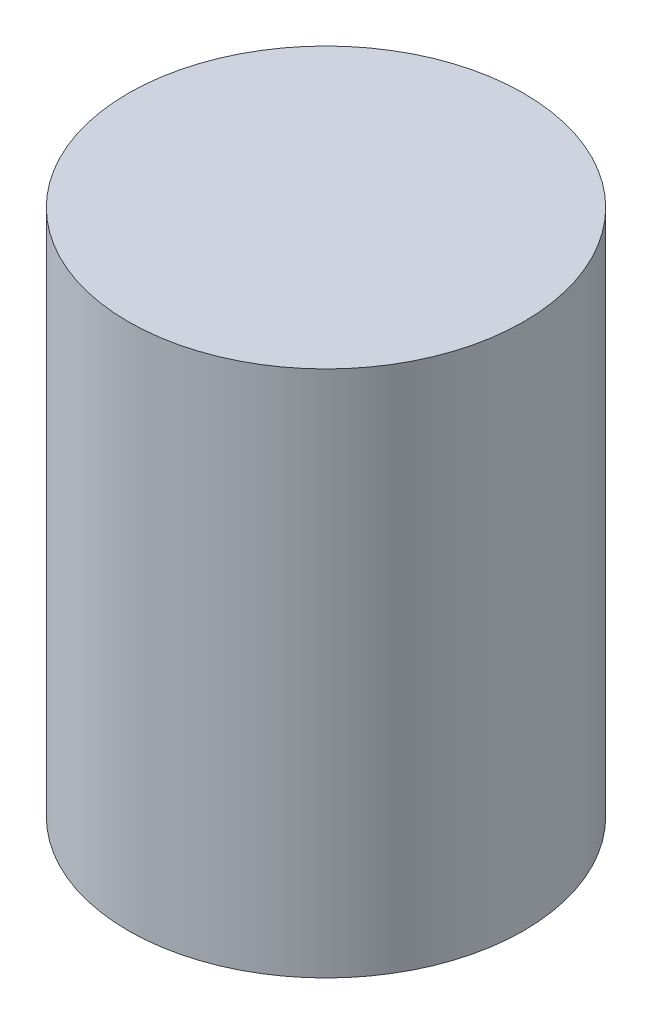
ISO-10303-21;
HEADER;
FILE_DESCRIPTION(('STEP AP214'),'2;1');
FILE_NAME('part.step','',(''),(''),'','','');
FILE_SCHEMA(('AUTOMOTIVE_DESIGN { 1 0 10303 214 1 1 1 1 }'));
ENDSEC;
DATA;
#1=APPLICATION_CONTEXT('core data for automotive mechanical design processes');
#2=APPLICATION_PROTOCOL_DEFINITION('international standard','automotive_design',2000,#1);
#3=PRODUCT_CONTEXT('',#1,'mechanical');
#4=PRODUCT('Part','Part','',(#3));
#5=PRODUCT_RELATED_PRODUCT_CATEGORY('part','',(#4));
#6=PRODUCT_DEFINITION_FORMATION('','',#4);
#7=PRODUCT_DEFINITION_CONTEXT('part definition',#1,'design');
#8=PRODUCT_DEFINITION('design','',#6,#7);
#9=PRODUCT_DEFINITION_SHAPE('','',#8);
#10=(LENGTH_UNIT() NAMED_UNIT(*) SI_UNIT(.MILLI.,.METRE.));
#11=(NAMED_UNIT(*) PLANE_ANGLE_UNIT() SI_UNIT($,.RADIAN.));
#12=(NAMED_UNIT(*) SI_UNIT($,.STERADIAN.) SOLID_ANGLE_UNIT());
#13=UNCERTAINTY_MEASURE_WITH_UNIT(LENGTH_MEASURE(1.E-05),#10,'distance_accuracy_value','');
#14=(GEOMETRIC_REPRESENTATION_CONTEXT(3) GLOBAL_UNCERTAINTY_ASSIGNED_CONTEXT((#13)) GLOBAL_UNIT_ASSIGNED_CONTEXT((#10,
#11,#12)) REPRESENTATION_CONTEXT('',''));
#15=CARTESIAN_POINT('',(0.,0.,0.));
#16=DIRECTION('',(0.,0.,1.));
#17=DIRECTION('',(1.,0.,0.));
#18=AXIS2_PLACEMENT_3D('',#15,#16,#17);
#19=CARTESIAN_POINT('',(0.,80.0000000000002,0.));
#20=DIRECTION('',(0.,1.00000000000001,0.));
#21=DIRECTION('',(0.,0.,1.));
#22=AXIS2_PLACEMENT_3D('',#19,#20,#21);
#23=PLANE('',#22);
#24=CARTESIAN_POINT('',(0.,80.0000000000002,0.));
#25=DIRECTION('',(0.,-1.00000000000001,0.));
#26=DIRECTION('',(0.,0.,-1.));
#27=AXIS2_PLACEMENT_3D('',#24,#25,#26);
#28=CIRCLE('',#27,30.);
#29=CARTESIAN_POINT('',(0.,80.0000000000002,-30.));
#30=VERTEX_POINT('',#29);
#31=EDGE_CURVE('E12',#30,#30,#28,.T.);
#32=ORIENTED_EDGE('',*,*,#31,.F.);
#33=EDGE_LOOP('',(#32));
#34=FACE_BOUND('',#33,.T.);
#35=ADVANCED_FACE('F40',(#34),#23,.T.);
#36=CARTESIAN_POINT('',(0.,0.,0.));
#37=DIRECTION('',(0.,-1.00000000000001,0.));
#38=DIRECTION('',(0.,0.,-1.));
#39=AXIS2_PLACEMENT_3D('',#36,#37,#38);
#40=CYLINDRICAL_SURFACE('',#39,30.);
#41=ORIENTED_EDGE('',*,*,#31,.T.);
#42=EDGE_LOOP('',(#41));
#43=FACE_BOUND('',#42,.T.);
#44=CARTESIAN_POINT('',(0.,0.,0.));
#45=DIRECTION('',(0.,-1.00000000000001,0.));
#46=DIRECTION('',(0.,0.,-1.));
#47=AXIS2_PLACEMENT_3D('',#44,#45,#46);
#48=CIRCLE('',#47,30.);
#49=CARTESIAN_POINT('',(0.,0.,-30.));
#50=VERTEX_POINT('',#49);
#51=EDGE_CURVE('E46',#50,#50,#48,.T.);
#52=ORIENTED_EDGE('',*,*,#51,.F.);
#53=EDGE_LOOP('',(#52));
#54=FACE_BOUND('',#53,.T.);
#55=ADVANCED_FACE('F54',(#43,#54),#40,.T.);
#56=CARTESIAN_POINT('',(30.0000000000002,0.,0.));
#57=DIRECTION('',(0.,-1.00000000000001,0.));
#58=DIRECTION('',(0.,0.,-1.));
#59=AXIS2_PLACEMENT_3D('',#56,#57,#58);
#60=PLANE('',#59);
#61=ORIENTED_EDGE('',*,*,#51,.T.);
#62=EDGE_LOOP('',(#61));
#63=FACE_BOUND('',#62,.T.);
#64=ADVANCED_FACE('F52',(#63),#60,.T.);
#65=CLOSED_SHELL('',(#35,#55,#64));
#66=MANIFOLD_SOLID_BREP('B2',#65);
#67=ADVANCED_BREP_SHAPE_REPRESENTATION('',(#18,#66),#14);
#68=SHAPE_DEFINITION_REPRESENTATION(#9,#67);
ENDSEC;
END-ISO-10303-21;
